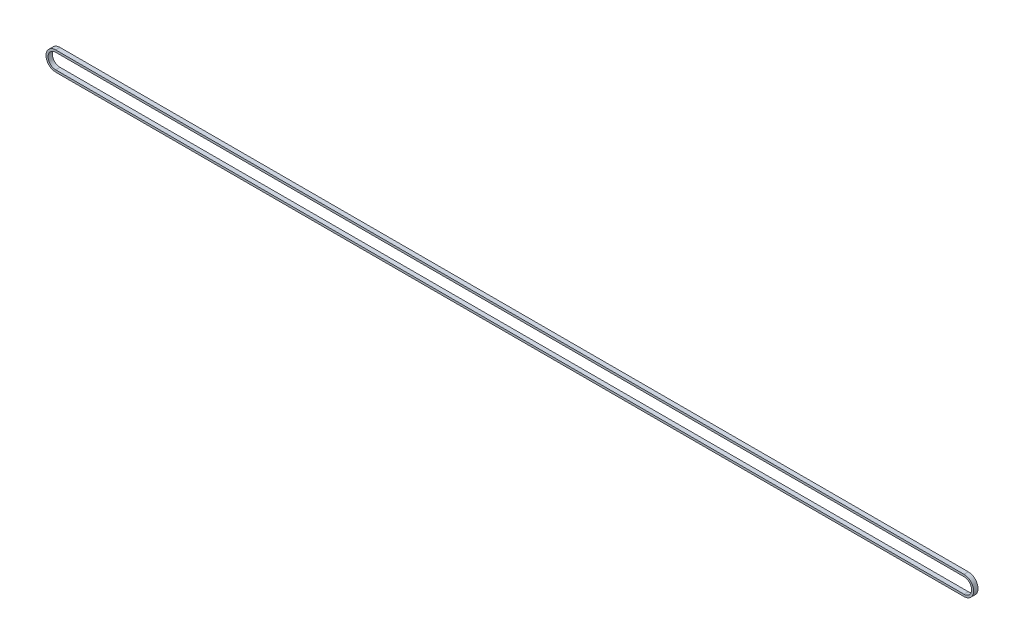
ISO-10303-21;
HEADER;
FILE_DESCRIPTION(('STEP AP214'),'2;1');
FILE_NAME('part.step','',(''),(''),'','','');
FILE_SCHEMA(('AUTOMOTIVE_DESIGN { 1 0 10303 214 1 1 1 1 }'));
ENDSEC;
DATA;
#1=APPLICATION_CONTEXT('core data for automotive mechanical design processes');
#2=APPLICATION_PROTOCOL_DEFINITION('international standard','automotive_design',2000,#1);
#3=PRODUCT_CONTEXT('',#1,'mechanical');
#4=PRODUCT('Part','Part','',(#3));
#5=PRODUCT_RELATED_PRODUCT_CATEGORY('part','',(#4));
#6=PRODUCT_DEFINITION_FORMATION('','',#4);
#7=PRODUCT_DEFINITION_CONTEXT('part definition',#1,'design');
#8=PRODUCT_DEFINITION('design','',#6,#7);
#9=PRODUCT_DEFINITION_SHAPE('','',#8);
#10=(LENGTH_UNIT() NAMED_UNIT(*) SI_UNIT(.MILLI.,.METRE.));
#11=(NAMED_UNIT(*) PLANE_ANGLE_UNIT() SI_UNIT($,.RADIAN.));
#12=(NAMED_UNIT(*) SI_UNIT($,.STERADIAN.) SOLID_ANGLE_UNIT());
#13=UNCERTAINTY_MEASURE_WITH_UNIT(LENGTH_MEASURE(1.E-05),#10,'distance_accuracy_value','');
#14=(GEOMETRIC_REPRESENTATION_CONTEXT(3) GLOBAL_UNCERTAINTY_ASSIGNED_CONTEXT((#13)) GLOBAL_UNIT_ASSIGNED_CONTEXT((#10,
#11,#12)) REPRESENTATION_CONTEXT('',''));
#15=CARTESIAN_POINT('',(0.,0.,0.));
#16=DIRECTION('',(0.,0.,1.));
#17=DIRECTION('',(1.,0.,0.));
#18=AXIS2_PLACEMENT_3D('',#15,#16,#17);
#19=CARTESIAN_POINT('',(0.,0.,2.5));
#20=DIRECTION('',(0.,0.,1.));
#21=DIRECTION('',(1.,0.,0.));
#22=AXIS2_PLACEMENT_3D('',#19,#20,#21);
#23=PLANE('',#22);
#24=CARTESIAN_POINT('',(0.,0.,2.5));
#25=DIRECTION('',(0.,0.,1.));
#26=DIRECTION('',(1.,0.,0.));
#27=AXIS2_PLACEMENT_3D('',#24,#25,#26);
#28=CIRCLE('',#27,11.15);
#29=CARTESIAN_POINT('',(0.,11.15,2.5));
#30=VERTEX_POINT('',#29);
#31=CARTESIAN_POINT('',(0.,-11.15,2.5));
#32=VERTEX_POINT('',#31);
#33=EDGE_CURVE('E157',#30,#32,#28,.T.);
#34=ORIENTED_EDGE('',*,*,#33,.T.);
#35=DIRECTION('',(1.,0.,0.));
#36=VECTOR('',#35,1.);
#37=CARTESIAN_POINT('',(1047.8,-11.15,2.5));
#38=LINE('',#37,#36);
#39=CARTESIAN_POINT('',(1047.8,-11.15,2.5));
#40=VERTEX_POINT('',#39);
#41=EDGE_CURVE('E160',#32,#40,#38,.T.);
#42=ORIENTED_EDGE('',*,*,#41,.T.);
#43=CARTESIAN_POINT('',(1047.8,0.,2.5));
#44=DIRECTION('',(0.,0.,1.));
#45=DIRECTION('',(1.,0.,0.));
#46=AXIS2_PLACEMENT_3D('',#43,#44,#45);
#47=CIRCLE('',#46,11.15);
#48=CARTESIAN_POINT('',(1047.8,11.15,2.5));
#49=VERTEX_POINT('',#48);
#50=EDGE_CURVE('E163',#40,#49,#47,.T.);
#51=ORIENTED_EDGE('',*,*,#50,.T.);
#52=DIRECTION('',(-1.,0.,0.));
#53=VECTOR('',#52,1.);
#54=CARTESIAN_POINT('',(0.,11.15,2.5));
#55=LINE('',#54,#53);
#56=EDGE_CURVE('E165',#49,#30,#55,.T.);
#57=ORIENTED_EDGE('',*,*,#56,.T.);
#58=EDGE_LOOP('',(#34,#42,#51,#57));
#59=FACE_BOUND('',#58,.T.);
#60=DIRECTION('',(1.,0.,0.));
#61=VECTOR('',#60,1.);
#62=CARTESIAN_POINT('',(1047.8,-8.75,2.5));
#63=LINE('',#62,#61);
#64=CARTESIAN_POINT('',(0.,-8.75,2.5));
#65=VERTEX_POINT('',#64);
#66=CARTESIAN_POINT('',(1047.8,-8.75,2.5));
#67=VERTEX_POINT('',#66);
#68=EDGE_CURVE('E129',#65,#67,#63,.T.);
#69=ORIENTED_EDGE('',*,*,#68,.F.);
#70=CARTESIAN_POINT('',(0.,0.,2.5));
#71=DIRECTION('',(0.,0.,1.));
#72=DIRECTION('',(1.,0.,0.));
#73=AXIS2_PLACEMENT_3D('',#70,#71,#72);
#74=CIRCLE('',#73,8.75);
#75=CARTESIAN_POINT('',(0.,8.75,2.5));
#76=VERTEX_POINT('',#75);
#77=EDGE_CURVE('E121',#76,#65,#74,.T.);
#78=ORIENTED_EDGE('',*,*,#77,.F.);
#79=DIRECTION('',(-1.,0.,0.));
#80=VECTOR('',#79,1.);
#81=CARTESIAN_POINT('',(0.,8.75,2.5));
#82=LINE('',#81,#80);
#83=CARTESIAN_POINT('',(1047.8,8.75,2.5));
#84=VERTEX_POINT('',#83);
#85=EDGE_CURVE('E143',#84,#76,#82,.T.);
#86=ORIENTED_EDGE('',*,*,#85,.F.);
#87=CARTESIAN_POINT('',(1047.8,0.,2.5));
#88=DIRECTION('',(0.,0.,1.));
#89=DIRECTION('',(1.,0.,0.));
#90=AXIS2_PLACEMENT_3D('',#87,#88,#89);
#91=CIRCLE('',#90,8.75);
#92=EDGE_CURVE('E141',#67,#84,#91,.T.);
#93=ORIENTED_EDGE('',*,*,#92,.F.);
#94=EDGE_LOOP('',(#69,#78,#86,#93));
#95=FACE_BOUND('',#94,.T.);
#96=ADVANCED_FACE('F56',(#59,#95),#23,.T.);
#97=CARTESIAN_POINT('',(0.,0.,-2.5));
#98=DIRECTION('',(0.,0.,1.));
#99=DIRECTION('',(1.,0.,0.));
#100=AXIS2_PLACEMENT_3D('',#97,#98,#99);
#101=PLANE('',#100);
#102=CARTESIAN_POINT('',(0.,0.,-2.5));
#103=DIRECTION('',(0.,0.,1.));
#104=DIRECTION('',(1.,0.,0.));
#105=AXIS2_PLACEMENT_3D('',#102,#103,#104);
#106=CIRCLE('',#105,11.15);
#107=CARTESIAN_POINT('',(0.,11.15,-2.5));
#108=VERTEX_POINT('',#107);
#109=CARTESIAN_POINT('',(0.,-11.15,-2.5));
#110=VERTEX_POINT('',#109);
#111=EDGE_CURVE('E137',#108,#110,#106,.T.);
#112=ORIENTED_EDGE('',*,*,#111,.F.);
#113=DIRECTION('',(-1.,0.,0.));
#114=VECTOR('',#113,1.);
#115=CARTESIAN_POINT('',(0.,11.15,-2.5));
#116=LINE('',#115,#114);
#117=CARTESIAN_POINT('',(1047.8,11.15,-2.5));
#118=VERTEX_POINT('',#117);
#119=EDGE_CURVE('E161',#118,#108,#116,.T.);
#120=ORIENTED_EDGE('',*,*,#119,.F.);
#121=CARTESIAN_POINT('',(1047.8,0.,-2.5));
#122=DIRECTION('',(0.,0.,1.));
#123=DIRECTION('',(1.,0.,0.));
#124=AXIS2_PLACEMENT_3D('',#121,#122,#123);
#125=CIRCLE('',#124,11.15);
#126=CARTESIAN_POINT('',(1047.8,-11.15,-2.5));
#127=VERTEX_POINT('',#126);
#128=EDGE_CURVE('E172',#127,#118,#125,.T.);
#129=ORIENTED_EDGE('',*,*,#128,.F.);
#130=DIRECTION('',(1.,0.,0.));
#131=VECTOR('',#130,1.);
#132=CARTESIAN_POINT('',(1047.8,-11.15,-2.5));
#133=LINE('',#132,#131);
#134=EDGE_CURVE('E170',#110,#127,#133,.T.);
#135=ORIENTED_EDGE('',*,*,#134,.F.);
#136=EDGE_LOOP('',(#112,#120,#129,#135));
#137=FACE_BOUND('',#136,.T.);
#138=CARTESIAN_POINT('',(0.,0.,-2.5));
#139=DIRECTION('',(0.,0.,1.));
#140=DIRECTION('',(1.,0.,0.));
#141=AXIS2_PLACEMENT_3D('',#138,#139,#140);
#142=CIRCLE('',#141,8.75);
#143=CARTESIAN_POINT('',(0.,8.75,-2.5));
#144=VERTEX_POINT('',#143);
#145=CARTESIAN_POINT('',(0.,-8.75,-2.5));
#146=VERTEX_POINT('',#145);
#147=EDGE_CURVE('E79',#144,#146,#142,.T.);
#148=ORIENTED_EDGE('',*,*,#147,.T.);
#149=DIRECTION('',(1.,0.,0.));
#150=VECTOR('',#149,1.);
#151=CARTESIAN_POINT('',(1047.8,-8.75,-2.5));
#152=LINE('',#151,#150);
#153=CARTESIAN_POINT('',(1047.8,-8.75,-2.5));
#154=VERTEX_POINT('',#153);
#155=EDGE_CURVE('E136',#146,#154,#152,.T.);
#156=ORIENTED_EDGE('',*,*,#155,.T.);
#157=CARTESIAN_POINT('',(1047.8,0.,-2.5));
#158=DIRECTION('',(0.,0.,1.));
#159=DIRECTION('',(1.,0.,0.));
#160=AXIS2_PLACEMENT_3D('',#157,#158,#159);
#161=CIRCLE('',#160,8.75);
#162=CARTESIAN_POINT('',(1047.8,8.75,-2.5));
#163=VERTEX_POINT('',#162);
#164=EDGE_CURVE('E149',#154,#163,#161,.T.);
#165=ORIENTED_EDGE('',*,*,#164,.T.);
#166=DIRECTION('',(-1.,0.,0.));
#167=VECTOR('',#166,1.);
#168=CARTESIAN_POINT('',(0.,8.75,-2.5));
#169=LINE('',#168,#167);
#170=EDGE_CURVE('E130',#163,#144,#169,.T.);
#171=ORIENTED_EDGE('',*,*,#170,.T.);
#172=EDGE_LOOP('',(#148,#156,#165,#171));
#173=FACE_BOUND('',#172,.T.);
#174=ADVANCED_FACE('F190',(#137,#173),#101,.F.);
#175=CARTESIAN_POINT('',(0.,0.,2.5));
#176=DIRECTION('',(0.,0.,-1.));
#177=DIRECTION('',(-1.,0.,0.));
#178=AXIS2_PLACEMENT_3D('',#175,#176,#177);
#179=CYLINDRICAL_SURFACE('',#178,11.15);
#180=ORIENTED_EDGE('',*,*,#111,.T.);
#181=DIRECTION('',(0.,0.,-1.));
#182=VECTOR('',#181,1.);
#183=CARTESIAN_POINT('',(0.,-11.15,2.5));
#184=LINE('',#183,#182);
#185=EDGE_CURVE('E12',#32,#110,#184,.T.);
#186=ORIENTED_EDGE('',*,*,#185,.F.);
#187=ORIENTED_EDGE('',*,*,#33,.F.);
#188=DIRECTION('',(0.,0.,-1.));
#189=VECTOR('',#188,1.);
#190=CARTESIAN_POINT('',(0.,11.15,2.5));
#191=LINE('',#190,#189);
#192=EDGE_CURVE('E167',#30,#108,#191,.T.);
#193=ORIENTED_EDGE('',*,*,#192,.T.);
#194=EDGE_LOOP('',(#180,#186,#187,#193));
#195=FACE_BOUND('',#194,.T.);
#196=ADVANCED_FACE('F58',(#195),#179,.T.);
#197=CARTESIAN_POINT('',(1047.8,-11.15,2.5));
#198=DIRECTION('',(0.,1.,0.));
#199=DIRECTION('',(0.,0.,1.));
#200=AXIS2_PLACEMENT_3D('',#197,#198,#199);
#201=PLANE('',#200);
#202=ORIENTED_EDGE('',*,*,#134,.T.);
#203=DIRECTION('',(0.,0.,-1.));
#204=VECTOR('',#203,1.);
#205=CARTESIAN_POINT('',(1047.8,-11.15,2.5));
#206=LINE('',#205,#204);
#207=EDGE_CURVE('E64',#40,#127,#206,.T.);
#208=ORIENTED_EDGE('',*,*,#207,.F.);
#209=ORIENTED_EDGE('',*,*,#41,.F.);
#210=ORIENTED_EDGE('',*,*,#185,.T.);
#211=EDGE_LOOP('',(#202,#208,#209,#210));
#212=FACE_BOUND('',#211,.T.);
#213=ADVANCED_FACE('F200',(#212),#201,.F.);
#214=CARTESIAN_POINT('',(1047.8,0.,2.5));
#215=DIRECTION('',(0.,0.,-1.));
#216=DIRECTION('',(-1.,0.,0.));
#217=AXIS2_PLACEMENT_3D('',#214,#215,#216);
#218=CYLINDRICAL_SURFACE('',#217,11.15);
#219=ORIENTED_EDGE('',*,*,#128,.T.);
#220=DIRECTION('',(0.,0.,-1.));
#221=VECTOR('',#220,1.);
#222=CARTESIAN_POINT('',(1047.8,11.15,2.5));
#223=LINE('',#222,#221);
#224=EDGE_CURVE('E177',#49,#118,#223,.T.);
#225=ORIENTED_EDGE('',*,*,#224,.F.);
#226=ORIENTED_EDGE('',*,*,#50,.F.);
#227=ORIENTED_EDGE('',*,*,#207,.T.);
#228=EDGE_LOOP('',(#219,#225,#226,#227));
#229=FACE_BOUND('',#228,.T.);
#230=ADVANCED_FACE('F184',(#229),#218,.T.);
#231=CARTESIAN_POINT('',(0.,11.15,2.5));
#232=DIRECTION('',(0.,-1.,0.));
#233=DIRECTION('',(0.,0.,-1.));
#234=AXIS2_PLACEMENT_3D('',#231,#232,#233);
#235=PLANE('',#234);
#236=ORIENTED_EDGE('',*,*,#119,.T.);
#237=ORIENTED_EDGE('',*,*,#192,.F.);
#238=ORIENTED_EDGE('',*,*,#56,.F.);
#239=ORIENTED_EDGE('',*,*,#224,.T.);
#240=EDGE_LOOP('',(#236,#237,#238,#239));
#241=FACE_BOUND('',#240,.T.);
#242=ADVANCED_FACE('F194',(#241),#235,.F.);
#243=CARTESIAN_POINT('',(0.,0.,2.5));
#244=DIRECTION('',(0.,0.,-1.));
#245=DIRECTION('',(-1.,0.,0.));
#246=AXIS2_PLACEMENT_3D('',#243,#244,#245);
#247=CYLINDRICAL_SURFACE('',#246,8.75);
#248=ORIENTED_EDGE('',*,*,#147,.F.);
#249=DIRECTION('',(0.,0.,-1.));
#250=VECTOR('',#249,1.);
#251=CARTESIAN_POINT('',(0.,8.75,2.5));
#252=LINE('',#251,#250);
#253=EDGE_CURVE('E125',#76,#144,#252,.T.);
#254=ORIENTED_EDGE('',*,*,#253,.F.);
#255=ORIENTED_EDGE('',*,*,#77,.T.);
#256=DIRECTION('',(0.,0.,-1.));
#257=VECTOR('',#256,1.);
#258=CARTESIAN_POINT('',(0.,-8.75,2.5));
#259=LINE('',#258,#257);
#260=EDGE_CURVE('E124',#65,#146,#259,.T.);
#261=ORIENTED_EDGE('',*,*,#260,.T.);
#262=EDGE_LOOP('',(#248,#254,#255,#261));
#263=FACE_BOUND('',#262,.T.);
#264=ADVANCED_FACE('F123',(#263),#247,.F.);
#265=CARTESIAN_POINT('',(1047.8,-8.75,2.5));
#266=DIRECTION('',(0.,1.,0.));
#267=DIRECTION('',(0.,0.,1.));
#268=AXIS2_PLACEMENT_3D('',#265,#266,#267);
#269=PLANE('',#268);
#270=ORIENTED_EDGE('',*,*,#155,.F.);
#271=ORIENTED_EDGE('',*,*,#260,.F.);
#272=ORIENTED_EDGE('',*,*,#68,.T.);
#273=DIRECTION('',(0.,0.,-1.));
#274=VECTOR('',#273,1.);
#275=CARTESIAN_POINT('',(1047.8,-8.75,2.5));
#276=LINE('',#275,#274);
#277=EDGE_CURVE('E138',#67,#154,#276,.T.);
#278=ORIENTED_EDGE('',*,*,#277,.T.);
#279=EDGE_LOOP('',(#270,#271,#272,#278));
#280=FACE_BOUND('',#279,.T.);
#281=ADVANCED_FACE('F133',(#280),#269,.T.);
#282=CARTESIAN_POINT('',(1047.8,0.,2.5));
#283=DIRECTION('',(0.,0.,-1.));
#284=DIRECTION('',(-1.,0.,0.));
#285=AXIS2_PLACEMENT_3D('',#282,#283,#284);
#286=CYLINDRICAL_SURFACE('',#285,8.75);
#287=ORIENTED_EDGE('',*,*,#164,.F.);
#288=ORIENTED_EDGE('',*,*,#277,.F.);
#289=ORIENTED_EDGE('',*,*,#92,.T.);
#290=DIRECTION('',(0.,0.,-1.));
#291=VECTOR('',#290,1.);
#292=CARTESIAN_POINT('',(1047.8,8.75,2.5));
#293=LINE('',#292,#291);
#294=EDGE_CURVE('E71',#84,#163,#293,.T.);
#295=ORIENTED_EDGE('',*,*,#294,.T.);
#296=EDGE_LOOP('',(#287,#288,#289,#295));
#297=FACE_BOUND('',#296,.T.);
#298=ADVANCED_FACE('F223',(#297),#286,.F.);
#299=CARTESIAN_POINT('',(0.,8.75,2.5));
#300=DIRECTION('',(0.,-1.,0.));
#301=DIRECTION('',(0.,0.,-1.));
#302=AXIS2_PLACEMENT_3D('',#299,#300,#301);
#303=PLANE('',#302);
#304=ORIENTED_EDGE('',*,*,#170,.F.);
#305=ORIENTED_EDGE('',*,*,#294,.F.);
#306=ORIENTED_EDGE('',*,*,#85,.T.);
#307=ORIENTED_EDGE('',*,*,#253,.T.);
#308=EDGE_LOOP('',(#304,#305,#306,#307));
#309=FACE_BOUND('',#308,.T.);
#310=ADVANCED_FACE('F227',(#309),#303,.T.);
#311=CLOSED_SHELL('',(#96,#174,#196,#213,#230,#242,#264,#281,#298,#310));
#312=MANIFOLD_SOLID_BREP('B2',#311);
#313=ADVANCED_BREP_SHAPE_REPRESENTATION('',(#18,#312),#14);
#314=SHAPE_DEFINITION_REPRESENTATION(#9,#313);
ENDSEC;
END-ISO-10303-21;
